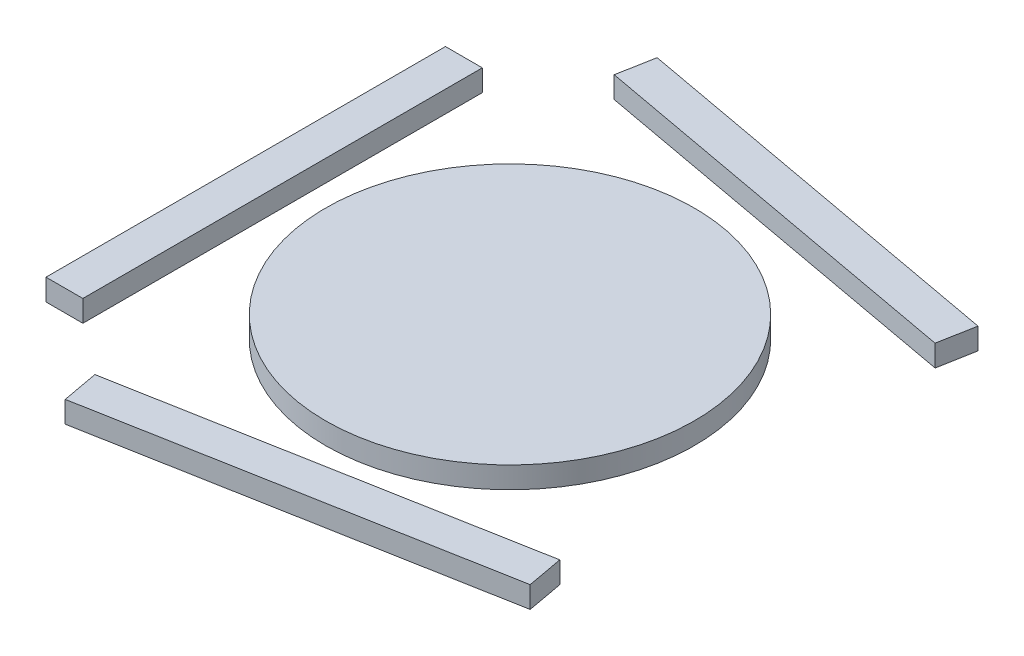
ISO-10303-21;
HEADER;
FILE_DESCRIPTION(('STEP AP214'),'2;1');
FILE_NAME('part.step','',(''),(''),'','','');
FILE_SCHEMA(('AUTOMOTIVE_DESIGN { 1 0 10303 214 1 1 1 1 }'));
ENDSEC;
DATA;
#1=APPLICATION_CONTEXT('core data for automotive mechanical design processes');
#2=APPLICATION_PROTOCOL_DEFINITION('international standard','automotive_design',2000,#1);
#3=PRODUCT_CONTEXT('',#1,'mechanical');
#4=PRODUCT('Part','Part','',(#3));
#5=PRODUCT_RELATED_PRODUCT_CATEGORY('part','',(#4));
#6=PRODUCT_DEFINITION_FORMATION('','',#4);
#7=PRODUCT_DEFINITION_CONTEXT('part definition',#1,'design');
#8=PRODUCT_DEFINITION('design','',#6,#7);
#9=PRODUCT_DEFINITION_SHAPE('','',#8);
#10=(LENGTH_UNIT() NAMED_UNIT(*) SI_UNIT(.MILLI.,.METRE.));
#11=(NAMED_UNIT(*) PLANE_ANGLE_UNIT() SI_UNIT($,.RADIAN.));
#12=(NAMED_UNIT(*) SI_UNIT($,.STERADIAN.) SOLID_ANGLE_UNIT());
#13=UNCERTAINTY_MEASURE_WITH_UNIT(LENGTH_MEASURE(1.E-05),#10,'distance_accuracy_value','');
#14=(GEOMETRIC_REPRESENTATION_CONTEXT(3) GLOBAL_UNCERTAINTY_ASSIGNED_CONTEXT((#13)) GLOBAL_UNIT_ASSIGNED_CONTEXT((#10,
#11,#12)) REPRESENTATION_CONTEXT('',''));
#15=CARTESIAN_POINT('',(0.,0.,0.));
#16=DIRECTION('',(0.,0.,1.));
#17=DIRECTION('',(1.,0.,0.));
#18=AXIS2_PLACEMENT_3D('',#15,#16,#17);
#19=CARTESIAN_POINT('',(-242.131147540983,35.,481.557377049181));
#20=DIRECTION('',(-0.180327868852459,0.,-0.983606557377049));
#21=DIRECTION('',(-0.983606557377049,0.,0.180327868852459));
#22=AXIS2_PLACEMENT_3D('',#19,#20,#21);
#23=PLANE('',#22);
#24=DIRECTION('',(0.983606557377049,0.,-0.180327868852459));
#25=VECTOR('',#24,1.);
#26=CARTESIAN_POINT('',(-242.131147540983,0.,481.557377049181));
#27=LINE('',#26,#25);
#28=CARTESIAN_POINT('',(-242.131147540983,0.,481.557377049181));
#29=VERTEX_POINT('',#28);
#30=CARTESIAN_POINT('',(397.213114754098,0.,364.344262295082));
#31=VERTEX_POINT('',#30);
#32=EDGE_CURVE('E109',#29,#31,#27,.T.);
#33=ORIENTED_EDGE('',*,*,#32,.T.);
#34=DIRECTION('',(0.,-1.,0.));
#35=VECTOR('',#34,1.);
#36=CARTESIAN_POINT('',(397.213114754098,35.,364.344262295082));
#37=LINE('',#36,#35);
#38=CARTESIAN_POINT('',(397.213114754098,35.,364.344262295082));
#39=VERTEX_POINT('',#38);
#40=EDGE_CURVE('E12',#39,#31,#37,.T.);
#41=ORIENTED_EDGE('',*,*,#40,.F.);
#42=DIRECTION('',(0.983606557377049,0.,-0.180327868852459));
#43=VECTOR('',#42,1.);
#44=CARTESIAN_POINT('',(-242.131147540983,35.,481.557377049181));
#45=LINE('',#44,#43);
#46=CARTESIAN_POINT('',(-242.131147540983,35.,481.557377049181));
#47=VERTEX_POINT('',#46);
#48=EDGE_CURVE('E97',#47,#39,#45,.T.);
#49=ORIENTED_EDGE('',*,*,#48,.F.);
#50=DIRECTION('',(0.,-1.,0.));
#51=VECTOR('',#50,1.);
#52=CARTESIAN_POINT('',(-242.131147540983,35.,481.557377049181));
#53=LINE('',#52,#51);
#54=EDGE_CURVE('E105',#47,#29,#53,.T.);
#55=ORIENTED_EDGE('',*,*,#54,.T.);
#56=EDGE_LOOP('',(#33,#41,#49,#55));
#57=FACE_BOUND('',#56,.T.);
#58=ADVANCED_FACE('F46',(#57),#23,.F.);
#59=CARTESIAN_POINT('',(397.213114754098,35.,364.344262295082));
#60=DIRECTION('',(-0.98360655737705,0.,0.180327868852457));
#61=DIRECTION('',(0.180327868852457,0.,0.98360655737705));
#62=AXIS2_PLACEMENT_3D('',#59,#60,#61);
#63=PLANE('',#62);
#64=DIRECTION('',(-0.180327868852457,0.,-0.98360655737705));
#65=VECTOR('',#64,1.);
#66=CARTESIAN_POINT('',(397.213114754098,0.,364.344262295082));
#67=LINE('',#66,#65);
#68=CARTESIAN_POINT('',(386.393442622951,0.,305.327868852459));
#69=VERTEX_POINT('',#68);
#70=EDGE_CURVE('E101',#31,#69,#67,.T.);
#71=ORIENTED_EDGE('',*,*,#70,.T.);
#72=DIRECTION('',(0.,-1.,0.));
#73=VECTOR('',#72,1.);
#74=CARTESIAN_POINT('',(386.393442622951,35.,305.327868852459));
#75=LINE('',#74,#73);
#76=CARTESIAN_POINT('',(386.393442622951,35.,305.327868852459));
#77=VERTEX_POINT('',#76);
#78=EDGE_CURVE('E54',#77,#69,#75,.T.);
#79=ORIENTED_EDGE('',*,*,#78,.F.);
#80=DIRECTION('',(-0.180327868852457,0.,-0.98360655737705));
#81=VECTOR('',#80,1.);
#82=CARTESIAN_POINT('',(397.213114754098,35.,364.344262295082));
#83=LINE('',#82,#81);
#84=EDGE_CURVE('E92',#39,#77,#83,.T.);
#85=ORIENTED_EDGE('',*,*,#84,.F.);
#86=ORIENTED_EDGE('',*,*,#40,.T.);
#87=EDGE_LOOP('',(#71,#79,#85,#86));
#88=FACE_BOUND('',#87,.T.);
#89=ADVANCED_FACE('F100',(#88),#63,.F.);
#90=CARTESIAN_POINT('',(-252.950819672131,35.,422.540983606558));
#91=DIRECTION('',(0.180327868852459,0.,0.983606557377049));
#92=DIRECTION('',(0.983606557377049,0.,-0.180327868852459));
#93=AXIS2_PLACEMENT_3D('',#90,#91,#92);
#94=PLANE('',#93);
#95=DIRECTION('',(-0.983606557377049,0.,0.180327868852459));
#96=VECTOR('',#95,1.);
#97=CARTESIAN_POINT('',(-252.950819672131,0.,422.540983606558));
#98=LINE('',#97,#96);
#99=CARTESIAN_POINT('',(-252.950819672131,0.,422.540983606558));
#100=VERTEX_POINT('',#99);
#101=EDGE_CURVE('E79',#69,#100,#98,.T.);
#102=ORIENTED_EDGE('',*,*,#101,.T.);
#103=DIRECTION('',(0.,-1.,0.));
#104=VECTOR('',#103,1.);
#105=CARTESIAN_POINT('',(-252.950819672131,35.,422.540983606558));
#106=LINE('',#105,#104);
#107=CARTESIAN_POINT('',(-252.950819672131,35.,422.540983606558));
#108=VERTEX_POINT('',#107);
#109=EDGE_CURVE('E102',#108,#100,#106,.T.);
#110=ORIENTED_EDGE('',*,*,#109,.F.);
#111=DIRECTION('',(-0.983606557377049,0.,0.180327868852459));
#112=VECTOR('',#111,1.);
#113=CARTESIAN_POINT('',(-252.950819672131,35.,422.540983606558));
#114=LINE('',#113,#112);
#115=EDGE_CURVE('E95',#77,#108,#114,.T.);
#116=ORIENTED_EDGE('',*,*,#115,.F.);
#117=ORIENTED_EDGE('',*,*,#78,.T.);
#118=EDGE_LOOP('',(#102,#110,#116,#117));
#119=FACE_BOUND('',#118,.T.);
#120=ADVANCED_FACE('F103',(#119),#94,.F.);
#121=CARTESIAN_POINT('',(-242.131147540983,35.,481.557377049181));
#122=DIRECTION('',(0.983606557377049,0.,-0.180327868852459));
#123=DIRECTION('',(-0.180327868852459,0.,-0.983606557377049));
#124=AXIS2_PLACEMENT_3D('',#121,#122,#123);
#125=PLANE('',#124);
#126=DIRECTION('',(0.180327868852459,0.,0.983606557377049));
#127=VECTOR('',#126,1.);
#128=CARTESIAN_POINT('',(-242.131147540983,0.,481.557377049181));
#129=LINE('',#128,#127);
#130=EDGE_CURVE('E85',#100,#29,#129,.T.);
#131=ORIENTED_EDGE('',*,*,#130,.T.);
#132=ORIENTED_EDGE('',*,*,#54,.F.);
#133=DIRECTION('',(0.180327868852459,0.,0.983606557377049));
#134=VECTOR('',#133,1.);
#135=CARTESIAN_POINT('',(-242.131147540983,35.,481.557377049181));
#136=LINE('',#135,#134);
#137=EDGE_CURVE('E62',#108,#47,#136,.T.);
#138=ORIENTED_EDGE('',*,*,#137,.F.);
#139=ORIENTED_EDGE('',*,*,#109,.T.);
#140=EDGE_LOOP('',(#131,#132,#138,#139));
#141=FACE_BOUND('',#140,.T.);
#142=ADVANCED_FACE('F116',(#141),#125,.F.);
#143=CARTESIAN_POINT('',(0.,35.,0.));
#144=DIRECTION('',(0.,1.,0.));
#145=DIRECTION('',(0.,0.,1.));
#146=AXIS2_PLACEMENT_3D('',#143,#144,#145);
#147=PLANE('',#146);
#148=ORIENTED_EDGE('',*,*,#48,.T.);
#149=ORIENTED_EDGE('',*,*,#84,.T.);
#150=ORIENTED_EDGE('',*,*,#115,.T.);
#151=ORIENTED_EDGE('',*,*,#137,.T.);
#152=EDGE_LOOP('',(#148,#149,#150,#151));
#153=FACE_BOUND('',#152,.T.);
#154=ADVANCED_FACE('F93',(#153),#147,.T.);
#155=CARTESIAN_POINT('',(0.,0.,0.));
#156=DIRECTION('',(0.,1.,0.));
#157=DIRECTION('',(0.,0.,1.));
#158=AXIS2_PLACEMENT_3D('',#155,#156,#157);
#159=PLANE('',#158);
#160=ORIENTED_EDGE('',*,*,#32,.F.);
#161=ORIENTED_EDGE('',*,*,#130,.F.);
#162=ORIENTED_EDGE('',*,*,#101,.F.);
#163=ORIENTED_EDGE('',*,*,#70,.F.);
#164=EDGE_LOOP('',(#160,#161,#162,#163));
#165=FACE_BOUND('',#164,.T.);
#166=ADVANCED_FACE('F119',(#165),#159,.F.);
#167=CLOSED_SHELL('',(#58,#89,#120,#142,#154,#166));
#168=MANIFOLD_SOLID_BREP('B2',#167);
#169=CARTESIAN_POINT('',(-430.,35.,325.));
#170=DIRECTION('',(1.,0.,0.));
#171=DIRECTION('',(0.,0.,-1.));
#172=AXIS2_PLACEMENT_3D('',#169,#170,#171);
#173=PLANE('',#172);
#174=DIRECTION('',(0.,0.,1.));
#175=VECTOR('',#174,1.);
#176=CARTESIAN_POINT('',(-430.,0.,325.));
#177=LINE('',#176,#175);
#178=CARTESIAN_POINT('',(-430.,0.,-325.));
#179=VERTEX_POINT('',#178);
#180=CARTESIAN_POINT('',(-430.,0.,325.));
#181=VERTEX_POINT('',#180);
#182=EDGE_CURVE('E243',#179,#181,#177,.T.);
#183=ORIENTED_EDGE('',*,*,#182,.T.);
#184=DIRECTION('',(0.,-1.,0.));
#185=VECTOR('',#184,1.);
#186=CARTESIAN_POINT('',(-430.,35.,325.));
#187=LINE('',#186,#185);
#188=CARTESIAN_POINT('',(-430.,35.,325.));
#189=VERTEX_POINT('',#188);
#190=EDGE_CURVE('E44',#189,#181,#187,.T.);
#191=ORIENTED_EDGE('',*,*,#190,.F.);
#192=DIRECTION('',(0.,0.,1.));
#193=VECTOR('',#192,1.);
#194=CARTESIAN_POINT('',(-430.,35.,325.));
#195=LINE('',#194,#193);
#196=CARTESIAN_POINT('',(-430.,35.,-325.));
#197=VERTEX_POINT('',#196);
#198=EDGE_CURVE('E231',#197,#189,#195,.T.);
#199=ORIENTED_EDGE('',*,*,#198,.F.);
#200=DIRECTION('',(0.,-1.,0.));
#201=VECTOR('',#200,1.);
#202=CARTESIAN_POINT('',(-430.,35.,-325.));
#203=LINE('',#202,#201);
#204=EDGE_CURVE('E239',#197,#179,#203,.T.);
#205=ORIENTED_EDGE('',*,*,#204,.T.);
#206=EDGE_LOOP('',(#183,#191,#199,#205));
#207=FACE_BOUND('',#206,.T.);
#208=ADVANCED_FACE('F180',(#207),#173,.F.);
#209=CARTESIAN_POINT('',(-430.,35.,325.));
#210=DIRECTION('',(0.,0.,-1.));
#211=DIRECTION('',(-1.,0.,0.));
#212=AXIS2_PLACEMENT_3D('',#209,#210,#211);
#213=PLANE('',#212);
#214=DIRECTION('',(1.,0.,0.));
#215=VECTOR('',#214,1.);
#216=CARTESIAN_POINT('',(-430.,0.,325.));
#217=LINE('',#216,#215);
#218=CARTESIAN_POINT('',(-370.,0.,325.));
#219=VERTEX_POINT('',#218);
#220=EDGE_CURVE('E235',#181,#219,#217,.T.);
#221=ORIENTED_EDGE('',*,*,#220,.T.);
#222=DIRECTION('',(0.,-1.,0.));
#223=VECTOR('',#222,1.);
#224=CARTESIAN_POINT('',(-370.,35.,325.));
#225=LINE('',#224,#223);
#226=CARTESIAN_POINT('',(-370.,35.,325.));
#227=VERTEX_POINT('',#226);
#228=EDGE_CURVE('E188',#227,#219,#225,.T.);
#229=ORIENTED_EDGE('',*,*,#228,.F.);
#230=DIRECTION('',(1.,0.,0.));
#231=VECTOR('',#230,1.);
#232=CARTESIAN_POINT('',(-430.,35.,325.));
#233=LINE('',#232,#231);
#234=EDGE_CURVE('E226',#189,#227,#233,.T.);
#235=ORIENTED_EDGE('',*,*,#234,.F.);
#236=ORIENTED_EDGE('',*,*,#190,.T.);
#237=EDGE_LOOP('',(#221,#229,#235,#236));
#238=FACE_BOUND('',#237,.T.);
#239=ADVANCED_FACE('F234',(#238),#213,.F.);
#240=CARTESIAN_POINT('',(-370.,35.,325.));
#241=DIRECTION('',(-1.,0.,0.));
#242=DIRECTION('',(0.,0.,1.));
#243=AXIS2_PLACEMENT_3D('',#240,#241,#242);
#244=PLANE('',#243);
#245=DIRECTION('',(0.,0.,-1.));
#246=VECTOR('',#245,1.);
#247=CARTESIAN_POINT('',(-370.,0.,325.));
#248=LINE('',#247,#246);
#249=CARTESIAN_POINT('',(-370.,0.,-325.));
#250=VERTEX_POINT('',#249);
#251=EDGE_CURVE('E213',#219,#250,#248,.T.);
#252=ORIENTED_EDGE('',*,*,#251,.T.);
#253=DIRECTION('',(0.,-1.,0.));
#254=VECTOR('',#253,1.);
#255=CARTESIAN_POINT('',(-370.,35.,-325.));
#256=LINE('',#255,#254);
#257=CARTESIAN_POINT('',(-370.,35.,-325.));
#258=VERTEX_POINT('',#257);
#259=EDGE_CURVE('E236',#258,#250,#256,.T.);
#260=ORIENTED_EDGE('',*,*,#259,.F.);
#261=DIRECTION('',(0.,0.,-1.));
#262=VECTOR('',#261,1.);
#263=CARTESIAN_POINT('',(-370.,35.,325.));
#264=LINE('',#263,#262);
#265=EDGE_CURVE('E229',#227,#258,#264,.T.);
#266=ORIENTED_EDGE('',*,*,#265,.F.);
#267=ORIENTED_EDGE('',*,*,#228,.T.);
#268=EDGE_LOOP('',(#252,#260,#266,#267));
#269=FACE_BOUND('',#268,.T.);
#270=ADVANCED_FACE('F237',(#269),#244,.F.);
#271=CARTESIAN_POINT('',(-430.,35.,-325.));
#272=DIRECTION('',(0.,0.,1.));
#273=DIRECTION('',(1.,0.,0.));
#274=AXIS2_PLACEMENT_3D('',#271,#272,#273);
#275=PLANE('',#274);
#276=DIRECTION('',(-1.,0.,0.));
#277=VECTOR('',#276,1.);
#278=CARTESIAN_POINT('',(-430.,0.,-325.));
#279=LINE('',#278,#277);
#280=EDGE_CURVE('E219',#250,#179,#279,.T.);
#281=ORIENTED_EDGE('',*,*,#280,.T.);
#282=ORIENTED_EDGE('',*,*,#204,.F.);
#283=DIRECTION('',(-1.,0.,0.));
#284=VECTOR('',#283,1.);
#285=CARTESIAN_POINT('',(-430.,35.,-325.));
#286=LINE('',#285,#284);
#287=EDGE_CURVE('E196',#258,#197,#286,.T.);
#288=ORIENTED_EDGE('',*,*,#287,.F.);
#289=ORIENTED_EDGE('',*,*,#259,.T.);
#290=EDGE_LOOP('',(#281,#282,#288,#289));
#291=FACE_BOUND('',#290,.T.);
#292=ADVANCED_FACE('F250',(#291),#275,.F.);
#293=CARTESIAN_POINT('',(0.,35.,0.));
#294=DIRECTION('',(0.,-1.,0.));
#295=DIRECTION('',(0.,0.,-1.));
#296=AXIS2_PLACEMENT_3D('',#293,#294,#295);
#297=PLANE('',#296);
#298=ORIENTED_EDGE('',*,*,#198,.T.);
#299=ORIENTED_EDGE('',*,*,#234,.T.);
#300=ORIENTED_EDGE('',*,*,#265,.T.);
#301=ORIENTED_EDGE('',*,*,#287,.T.);
#302=EDGE_LOOP('',(#298,#299,#300,#301));
#303=FACE_BOUND('',#302,.T.);
#304=ADVANCED_FACE('F227',(#303),#297,.F.);
#305=CARTESIAN_POINT('',(0.,0.,0.));
#306=DIRECTION('',(0.,-1.,0.));
#307=DIRECTION('',(0.,0.,-1.));
#308=AXIS2_PLACEMENT_3D('',#305,#306,#307);
#309=PLANE('',#308);
#310=ORIENTED_EDGE('',*,*,#182,.F.);
#311=ORIENTED_EDGE('',*,*,#280,.F.);
#312=ORIENTED_EDGE('',*,*,#251,.F.);
#313=ORIENTED_EDGE('',*,*,#220,.F.);
#314=EDGE_LOOP('',(#310,#311,#312,#313));
#315=FACE_BOUND('',#314,.T.);
#316=ADVANCED_FACE('F253',(#315),#309,.T.);
#317=CLOSED_SHELL('',(#208,#239,#270,#292,#304,#316));
#318=MANIFOLD_SOLID_BREP('B6',#317);
#319=CARTESIAN_POINT('',(397.213114754099,35.,-364.344262295082));
#320=DIRECTION('',(-0.983606557377049,0.,-0.18032786885246));
#321=DIRECTION('',(-0.18032786885246,0.,0.983606557377049));
#322=AXIS2_PLACEMENT_3D('',#319,#320,#321);
#323=PLANE('',#322);
#324=DIRECTION('',(0.180327868852461,0.,-0.983606557377049));
#325=VECTOR('',#324,1.);
#326=CARTESIAN_POINT('',(397.213114754099,0.,-364.344262295082));
#327=LINE('',#326,#325);
#328=CARTESIAN_POINT('',(386.393442622951,0.,-305.327868852459));
#329=VERTEX_POINT('',#328);
#330=CARTESIAN_POINT('',(397.213114754099,0.,-364.344262295082));
#331=VERTEX_POINT('',#330);
#332=EDGE_CURVE('E374',#329,#331,#327,.T.);
#333=ORIENTED_EDGE('',*,*,#332,.T.);
#334=DIRECTION('',(0.,-1.,0.));
#335=VECTOR('',#334,1.);
#336=CARTESIAN_POINT('',(397.213114754099,35.,-364.344262295082));
#337=LINE('',#336,#335);
#338=CARTESIAN_POINT('',(397.213114754099,35.,-364.344262295082));
#339=VERTEX_POINT('',#338);
#340=EDGE_CURVE('E178',#339,#331,#337,.T.);
#341=ORIENTED_EDGE('',*,*,#340,.F.);
#342=DIRECTION('',(0.180327868852461,0.,-0.983606557377049));
#343=VECTOR('',#342,1.);
#344=CARTESIAN_POINT('',(397.213114754099,35.,-364.344262295082));
#345=LINE('',#344,#343);
#346=CARTESIAN_POINT('',(386.393442622951,35.,-305.327868852459));
#347=VERTEX_POINT('',#346);
#348=EDGE_CURVE('E362',#347,#339,#345,.T.);
#349=ORIENTED_EDGE('',*,*,#348,.F.);
#350=DIRECTION('',(0.,-1.,0.));
#351=VECTOR('',#350,1.);
#352=CARTESIAN_POINT('',(386.393442622951,35.,-305.327868852459));
#353=LINE('',#352,#351);
#354=EDGE_CURVE('E370',#347,#329,#353,.T.);
#355=ORIENTED_EDGE('',*,*,#354,.T.);
#356=EDGE_LOOP('',(#333,#341,#349,#355));
#357=FACE_BOUND('',#356,.T.);
#358=ADVANCED_FACE('F311',(#357),#323,.F.);
#359=CARTESIAN_POINT('',(397.213114754099,35.,-364.344262295082));
#360=DIRECTION('',(-0.180327868852459,0.,0.983606557377049));
#361=DIRECTION('',(0.983606557377049,0.,0.180327868852459));
#362=AXIS2_PLACEMENT_3D('',#359,#360,#361);
#363=PLANE('',#362);
#364=DIRECTION('',(-0.983606557377049,0.,-0.180327868852459));
#365=VECTOR('',#364,1.);
#366=CARTESIAN_POINT('',(397.213114754099,0.,-364.344262295082));
#367=LINE('',#366,#365);
#368=CARTESIAN_POINT('',(-242.131147540984,0.,-481.55737704918));
#369=VERTEX_POINT('',#368);
#370=EDGE_CURVE('E366',#331,#369,#367,.T.);
#371=ORIENTED_EDGE('',*,*,#370,.T.);
#372=DIRECTION('',(0.,-1.,0.));
#373=VECTOR('',#372,1.);
#374=CARTESIAN_POINT('',(-242.131147540984,35.,-481.55737704918));
#375=LINE('',#374,#373);
#376=CARTESIAN_POINT('',(-242.131147540984,35.,-481.55737704918));
#377=VERTEX_POINT('',#376);
#378=EDGE_CURVE('E319',#377,#369,#375,.T.);
#379=ORIENTED_EDGE('',*,*,#378,.F.);
#380=DIRECTION('',(-0.983606557377049,0.,-0.180327868852459));
#381=VECTOR('',#380,1.);
#382=CARTESIAN_POINT('',(397.213114754099,35.,-364.344262295082));
#383=LINE('',#382,#381);
#384=EDGE_CURVE('E357',#339,#377,#383,.T.);
#385=ORIENTED_EDGE('',*,*,#384,.F.);
#386=ORIENTED_EDGE('',*,*,#340,.T.);
#387=EDGE_LOOP('',(#371,#379,#385,#386));
#388=FACE_BOUND('',#387,.T.);
#389=ADVANCED_FACE('F365',(#388),#363,.F.);
#390=CARTESIAN_POINT('',(-242.131147540984,35.,-481.55737704918));
#391=DIRECTION('',(0.983606557377049,0.,0.180327868852458));
#392=DIRECTION('',(0.180327868852458,0.,-0.983606557377049));
#393=AXIS2_PLACEMENT_3D('',#390,#391,#392);
#394=PLANE('',#393);
#395=DIRECTION('',(-0.180327868852458,0.,0.983606557377049));
#396=VECTOR('',#395,1.);
#397=CARTESIAN_POINT('',(-242.131147540984,0.,-481.55737704918));
#398=LINE('',#397,#396);
#399=CARTESIAN_POINT('',(-252.950819672131,0.,-422.540983606557));
#400=VERTEX_POINT('',#399);
#401=EDGE_CURVE('E344',#369,#400,#398,.T.);
#402=ORIENTED_EDGE('',*,*,#401,.T.);
#403=DIRECTION('',(0.,-1.,0.));
#404=VECTOR('',#403,1.);
#405=CARTESIAN_POINT('',(-252.950819672131,35.,-422.540983606557));
#406=LINE('',#405,#404);
#407=CARTESIAN_POINT('',(-252.950819672131,35.,-422.540983606557));
#408=VERTEX_POINT('',#407);
#409=EDGE_CURVE('E367',#408,#400,#406,.T.);
#410=ORIENTED_EDGE('',*,*,#409,.F.);
#411=DIRECTION('',(-0.180327868852458,0.,0.983606557377049));
#412=VECTOR('',#411,1.);
#413=CARTESIAN_POINT('',(-242.131147540984,35.,-481.55737704918));
#414=LINE('',#413,#412);
#415=EDGE_CURVE('E360',#377,#408,#414,.T.);
#416=ORIENTED_EDGE('',*,*,#415,.F.);
#417=ORIENTED_EDGE('',*,*,#378,.T.);
#418=EDGE_LOOP('',(#402,#410,#416,#417));
#419=FACE_BOUND('',#418,.T.);
#420=ADVANCED_FACE('F368',(#419),#394,.F.);
#421=CARTESIAN_POINT('',(386.393442622951,35.,-305.327868852459));
#422=DIRECTION('',(0.180327868852459,0.,-0.983606557377049));
#423=DIRECTION('',(-0.983606557377049,0.,-0.180327868852459));
#424=AXIS2_PLACEMENT_3D('',#421,#422,#423);
#425=PLANE('',#424);
#426=DIRECTION('',(0.983606557377049,0.,0.180327868852459));
#427=VECTOR('',#426,1.);
#428=CARTESIAN_POINT('',(386.393442622951,0.,-305.327868852459));
#429=LINE('',#428,#427);
#430=EDGE_CURVE('E350',#400,#329,#429,.T.);
#431=ORIENTED_EDGE('',*,*,#430,.T.);
#432=ORIENTED_EDGE('',*,*,#354,.F.);
#433=DIRECTION('',(0.983606557377049,0.,0.180327868852459));
#434=VECTOR('',#433,1.);
#435=CARTESIAN_POINT('',(386.393442622951,35.,-305.327868852459));
#436=LINE('',#435,#434);
#437=EDGE_CURVE('E327',#408,#347,#436,.T.);
#438=ORIENTED_EDGE('',*,*,#437,.F.);
#439=ORIENTED_EDGE('',*,*,#409,.T.);
#440=EDGE_LOOP('',(#431,#432,#438,#439));
#441=FACE_BOUND('',#440,.T.);
#442=ADVANCED_FACE('F381',(#441),#425,.F.);
#443=CARTESIAN_POINT('',(0.,35.,0.));
#444=DIRECTION('',(0.,-1.,0.));
#445=DIRECTION('',(0.,0.,-1.));
#446=AXIS2_PLACEMENT_3D('',#443,#444,#445);
#447=PLANE('',#446);
#448=ORIENTED_EDGE('',*,*,#348,.T.);
#449=ORIENTED_EDGE('',*,*,#384,.T.);
#450=ORIENTED_EDGE('',*,*,#415,.T.);
#451=ORIENTED_EDGE('',*,*,#437,.T.);
#452=EDGE_LOOP('',(#448,#449,#450,#451));
#453=FACE_BOUND('',#452,.T.);
#454=ADVANCED_FACE('F358',(#453),#447,.F.);
#455=CARTESIAN_POINT('',(0.,0.,0.));
#456=DIRECTION('',(0.,-1.,0.));
#457=DIRECTION('',(0.,0.,-1.));
#458=AXIS2_PLACEMENT_3D('',#455,#456,#457);
#459=PLANE('',#458);
#460=ORIENTED_EDGE('',*,*,#332,.F.);
#461=ORIENTED_EDGE('',*,*,#430,.F.);
#462=ORIENTED_EDGE('',*,*,#401,.F.);
#463=ORIENTED_EDGE('',*,*,#370,.F.);
#464=EDGE_LOOP('',(#460,#461,#462,#463));
#465=FACE_BOUND('',#464,.T.);
#466=ADVANCED_FACE('F384',(#465),#459,.T.);
#467=CLOSED_SHELL('',(#358,#389,#420,#442,#454,#466));
#468=MANIFOLD_SOLID_BREP('B38',#467);
#469=CARTESIAN_POINT('',(0.,35.,0.));
#470=DIRECTION('',(0.,-1.,0.));
#471=DIRECTION('',(0.,0.,-1.));
#472=AXIS2_PLACEMENT_3D('',#469,#470,#471);
#473=CYLINDRICAL_SURFACE('',#472,300.);
#474=CARTESIAN_POINT('',(0.,35.,0.));
#475=DIRECTION('',(0.,1.,0.));
#476=DIRECTION('',(0.,0.,1.));
#477=AXIS2_PLACEMENT_3D('',#474,#475,#476);
#478=CIRCLE('',#477,300.);
#479=CARTESIAN_POINT('',(0.,35.,300.));
#480=VERTEX_POINT('',#479);
#481=EDGE_CURVE('E310',#480,#480,#478,.T.);
#482=ORIENTED_EDGE('',*,*,#481,.F.);
#483=EDGE_LOOP('',(#482));
#484=FACE_BOUND('',#483,.T.);
#485=CARTESIAN_POINT('',(0.,0.,0.));
#486=DIRECTION('',(0.,1.,0.));
#487=DIRECTION('',(0.,0.,1.));
#488=AXIS2_PLACEMENT_3D('',#485,#486,#487);
#489=CIRCLE('',#488,300.);
#490=CARTESIAN_POINT('',(0.,0.,300.));
#491=VERTEX_POINT('',#490);
#492=EDGE_CURVE('E438',#491,#491,#489,.T.);
#493=ORIENTED_EDGE('',*,*,#492,.T.);
#494=EDGE_LOOP('',(#493));
#495=FACE_BOUND('',#494,.T.);
#496=ADVANCED_FACE('F435',(#484,#495),#473,.T.);
#497=CARTESIAN_POINT('',(0.,35.,0.));
#498=DIRECTION('',(0.,1.,0.));
#499=DIRECTION('',(0.,0.,1.));
#500=AXIS2_PLACEMENT_3D('',#497,#498,#499);
#501=PLANE('',#500);
#502=ORIENTED_EDGE('',*,*,#481,.T.);
#503=EDGE_LOOP('',(#502));
#504=FACE_BOUND('',#503,.T.);
#505=ADVANCED_FACE('F450',(#504),#501,.T.);
#506=CARTESIAN_POINT('',(0.,0.,0.));
#507=DIRECTION('',(0.,1.,0.));
#508=DIRECTION('',(0.,0.,1.));
#509=AXIS2_PLACEMENT_3D('',#506,#507,#508);
#510=PLANE('',#509);
#511=ORIENTED_EDGE('',*,*,#492,.F.);
#512=EDGE_LOOP('',(#511));
#513=FACE_BOUND('',#512,.T.);
#514=ADVANCED_FACE('F448',(#513),#510,.F.);
#515=CLOSED_SHELL('',(#496,#505,#514));
#516=MANIFOLD_SOLID_BREP('B172',#515);
#517=ADVANCED_BREP_SHAPE_REPRESENTATION('',(#18,#168,#318,#468,#516),#14);
#518=SHAPE_DEFINITION_REPRESENTATION(#9,#517);
ENDSEC;
END-ISO-10303-21;
